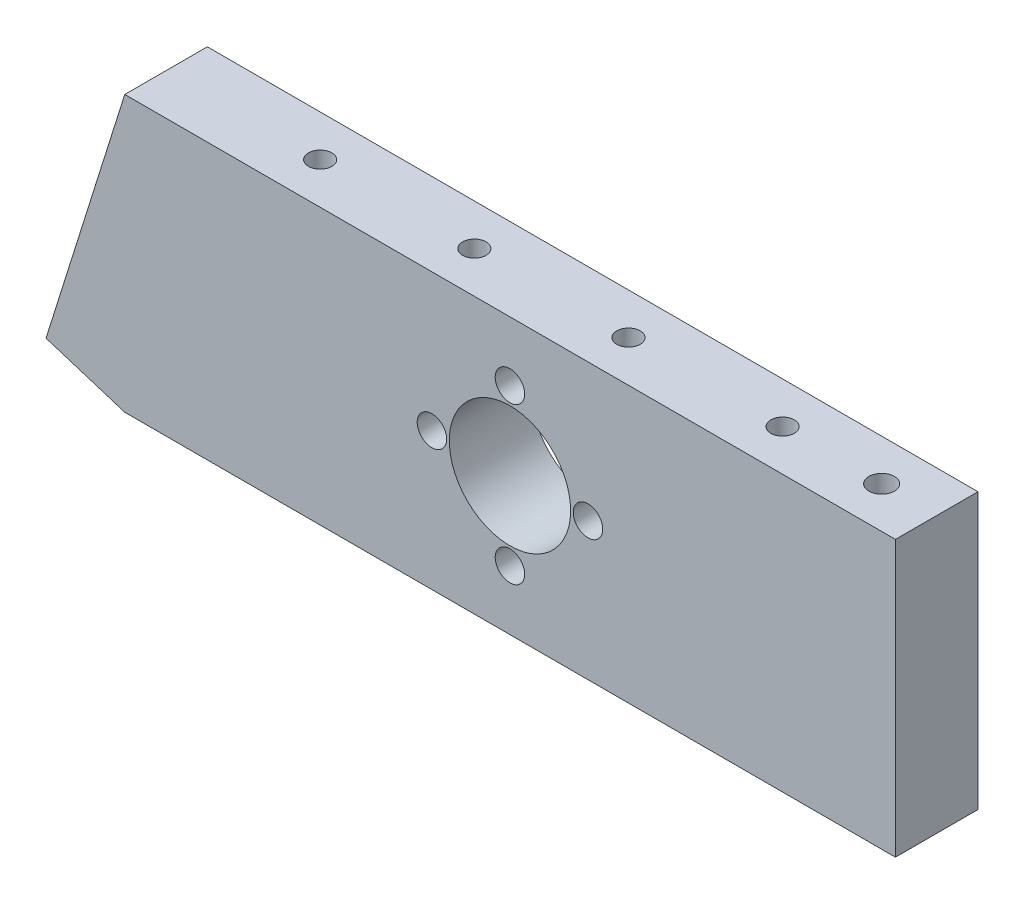
ISO-10303-21;
HEADER;
FILE_DESCRIPTION(('STEP AP214'),'2;1');
FILE_NAME('part.step','',(''),(''),'','','');
FILE_SCHEMA(('AUTOMOTIVE_DESIGN { 1 0 10303 214 1 1 1 1 }'));
ENDSEC;
DATA;
#1=APPLICATION_CONTEXT('core data for automotive mechanical design processes');
#2=APPLICATION_PROTOCOL_DEFINITION('international standard','automotive_design',2000,#1);
#3=PRODUCT_CONTEXT('',#1,'mechanical');
#4=PRODUCT('Part','Part','',(#3));
#5=PRODUCT_RELATED_PRODUCT_CATEGORY('part','',(#4));
#6=PRODUCT_DEFINITION_FORMATION('','',#4);
#7=PRODUCT_DEFINITION_CONTEXT('part definition',#1,'design');
#8=PRODUCT_DEFINITION('design','',#6,#7);
#9=PRODUCT_DEFINITION_SHAPE('','',#8);
#10=(LENGTH_UNIT() NAMED_UNIT(*) SI_UNIT(.MILLI.,.METRE.));
#11=(NAMED_UNIT(*) PLANE_ANGLE_UNIT() SI_UNIT($,.RADIAN.));
#12=(NAMED_UNIT(*) SI_UNIT($,.STERADIAN.) SOLID_ANGLE_UNIT());
#13=UNCERTAINTY_MEASURE_WITH_UNIT(LENGTH_MEASURE(1.E-05),#10,'distance_accuracy_value','');
#14=(GEOMETRIC_REPRESENTATION_CONTEXT(3) GLOBAL_UNCERTAINTY_ASSIGNED_CONTEXT((#13)) GLOBAL_UNIT_ASSIGNED_CONTEXT((#10,
#11,#12)) REPRESENTATION_CONTEXT('',''));
#15=CARTESIAN_POINT('',(0.,0.,0.));
#16=DIRECTION('',(0.,0.,1.));
#17=DIRECTION('',(1.,0.,0.));
#18=AXIS2_PLACEMENT_3D('',#15,#16,#17);
#19=CARTESIAN_POINT('',(0.,0.,9.525));
#20=DIRECTION('',(0.,0.,1.));
#21=DIRECTION('',(1.,0.,0.));
#22=AXIS2_PLACEMENT_3D('',#19,#20,#21);
#23=PLANE('',#22);
#24=CARTESIAN_POINT('',(9.,0.,9.525));
#25=DIRECTION('',(0.,0.,1.));
#26=DIRECTION('',(1.,0.,0.));
#27=AXIS2_PLACEMENT_3D('',#24,#25,#26);
#28=CIRCLE('',#27,1.7);
#29=CARTESIAN_POINT('',(10.7,0.,9.525));
#30=VERTEX_POINT('',#29);
#31=EDGE_CURVE('E324',#30,#30,#28,.T.);
#32=ORIENTED_EDGE('',*,*,#31,.F.);
#33=EDGE_LOOP('',(#32));
#34=FACE_BOUND('',#33,.T.);
#35=CARTESIAN_POINT('',(-9.,0.,9.525));
#36=DIRECTION('',(0.,0.,1.));
#37=DIRECTION('',(1.,0.,0.));
#38=AXIS2_PLACEMENT_3D('',#35,#36,#37);
#39=CIRCLE('',#38,1.7);
#40=CARTESIAN_POINT('',(-7.3,0.,9.525));
#41=VERTEX_POINT('',#40);
#42=EDGE_CURVE('E336',#41,#41,#39,.T.);
#43=ORIENTED_EDGE('',*,*,#42,.F.);
#44=EDGE_LOOP('',(#43));
#45=FACE_BOUND('',#44,.T.);
#46=DIRECTION('',(0.,1.,0.));
#47=VECTOR('',#46,1.);
#48=CARTESIAN_POINT('',(44.4670417670357,15.875,9.525));
#49=LINE('',#48,#47);
#50=CARTESIAN_POINT('',(44.4670417670356,-15.875,9.525));
#51=VERTEX_POINT('',#50);
#52=CARTESIAN_POINT('',(44.4670417670357,15.875,9.525));
#53=VERTEX_POINT('',#52);
#54=EDGE_CURVE('E125',#51,#53,#49,.T.);
#55=ORIENTED_EDGE('',*,*,#54,.T.);
#56=DIRECTION('',(-1.,0.,0.));
#57=VECTOR('',#56,1.);
#58=CARTESIAN_POINT('',(-44.4329582329643,15.875,9.525));
#59=LINE('',#58,#57);
#60=CARTESIAN_POINT('',(-44.4329582329643,15.875,9.525));
#61=VERTEX_POINT('',#60);
#62=EDGE_CURVE('E90',#53,#61,#59,.T.);
#63=ORIENTED_EDGE('',*,*,#62,.T.);
#64=DIRECTION('',(-0.299999999999992,-0.953939201416948,0.));
#65=VECTOR('',#64,1.);
#66=CARTESIAN_POINT('',(-44.4329582329643,15.875,9.525));
#67=LINE('',#66,#65);
#68=CARTESIAN_POINT('',(-53.5192291264606,-13.0175000000005,9.525));
#69=VERTEX_POINT('',#68);
#70=EDGE_CURVE('E96',#61,#69,#67,.T.);
#71=ORIENTED_EDGE('',*,*,#70,.T.);
#72=DIRECTION('',(0.953939201416947,-0.299999999999997,0.));
#73=VECTOR('',#72,1.);
#74=CARTESIAN_POINT('',(-44.4329582329642,-15.8750000000004,9.525));
#75=LINE('',#74,#73);
#76=CARTESIAN_POINT('',(-44.4329582329642,-15.8750000000004,9.525));
#77=VERTEX_POINT('',#76);
#78=EDGE_CURVE('E100',#69,#77,#75,.T.);
#79=ORIENTED_EDGE('',*,*,#78,.T.);
#80=DIRECTION('',(1.,0.,0.));
#81=VECTOR('',#80,1.);
#82=CARTESIAN_POINT('',(-44.4329582329642,-15.8750000000004,9.525));
#83=LINE('',#82,#81);
#84=EDGE_CURVE('E55',#77,#51,#83,.T.);
#85=ORIENTED_EDGE('',*,*,#84,.T.);
#86=EDGE_LOOP('',(#55,#63,#71,#79,#85));
#87=FACE_BOUND('',#86,.T.);
#88=CARTESIAN_POINT('',(0.,-9.00000000000001,9.525));
#89=DIRECTION('',(0.,0.,1.));
#90=DIRECTION('',(1.,0.,0.));
#91=AXIS2_PLACEMENT_3D('',#88,#89,#90);
#92=CIRCLE('',#91,1.7);
#93=CARTESIAN_POINT('',(1.7,-9.00000000000001,9.525));
#94=VERTEX_POINT('',#93);
#95=EDGE_CURVE('E120',#94,#94,#92,.T.);
#96=ORIENTED_EDGE('',*,*,#95,.F.);
#97=EDGE_LOOP('',(#96));
#98=FACE_BOUND('',#97,.T.);
#99=CARTESIAN_POINT('',(0.,9.,9.525));
#100=DIRECTION('',(0.,0.,1.));
#101=DIRECTION('',(1.,0.,0.));
#102=AXIS2_PLACEMENT_3D('',#99,#100,#101);
#103=CIRCLE('',#102,1.7);
#104=CARTESIAN_POINT('',(1.7,9.,9.525));
#105=VERTEX_POINT('',#104);
#106=EDGE_CURVE('E330',#105,#105,#103,.T.);
#107=ORIENTED_EDGE('',*,*,#106,.F.);
#108=EDGE_LOOP('',(#107));
#109=FACE_BOUND('',#108,.T.);
#110=CARTESIAN_POINT('',(1.95156391047391E-13,1.94289029309402E-13,9.525));
#111=DIRECTION('',(0.,0.,1.));
#112=DIRECTION('',(1.,0.,0.));
#113=AXIS2_PLACEMENT_3D('',#110,#111,#112);
#114=CIRCLE('',#113,6.99999999999976);
#115=CARTESIAN_POINT('',(6.99999999999995,1.94289029309402E-13,9.525));
#116=VERTEX_POINT('',#115);
#117=EDGE_CURVE('E318',#116,#116,#114,.T.);
#118=ORIENTED_EDGE('',*,*,#117,.F.);
#119=EDGE_LOOP('',(#118));
#120=FACE_BOUND('',#119,.T.);
#121=ADVANCED_FACE('F38',(#34,#45,#87,#98,#109,#120),#23,.T.);
#122=CARTESIAN_POINT('',(0.,0.,0.));
#123=DIRECTION('',(0.,0.,1.));
#124=DIRECTION('',(1.,0.,0.));
#125=AXIS2_PLACEMENT_3D('',#122,#123,#124);
#126=PLANE('',#125);
#127=DIRECTION('',(0.,1.,0.));
#128=VECTOR('',#127,1.);
#129=CARTESIAN_POINT('',(44.4670417670357,15.875,0.));
#130=LINE('',#129,#128);
#131=CARTESIAN_POINT('',(44.4670417670356,-15.875,0.));
#132=VERTEX_POINT('',#131);
#133=CARTESIAN_POINT('',(44.4670417670357,15.875,0.));
#134=VERTEX_POINT('',#133);
#135=EDGE_CURVE('E116',#132,#134,#130,.T.);
#136=ORIENTED_EDGE('',*,*,#135,.F.);
#137=DIRECTION('',(1.,0.,0.));
#138=VECTOR('',#137,1.);
#139=CARTESIAN_POINT('',(-44.4329582329642,-15.8750000000004,0.));
#140=LINE('',#139,#138);
#141=CARTESIAN_POINT('',(-44.4329582329642,-15.8750000000004,0.));
#142=VERTEX_POINT('',#141);
#143=EDGE_CURVE('E82',#142,#132,#140,.T.);
#144=ORIENTED_EDGE('',*,*,#143,.F.);
#145=DIRECTION('',(0.953939201416947,-0.299999999999997,0.));
#146=VECTOR('',#145,1.);
#147=CARTESIAN_POINT('',(-44.4329582329642,-15.8750000000004,0.));
#148=LINE('',#147,#146);
#149=CARTESIAN_POINT('',(-53.5192291264606,-13.0175000000005,0.));
#150=VERTEX_POINT('',#149);
#151=EDGE_CURVE('E76',#150,#142,#148,.T.);
#152=ORIENTED_EDGE('',*,*,#151,.F.);
#153=DIRECTION('',(-0.299999999999992,-0.953939201416948,0.));
#154=VECTOR('',#153,1.);
#155=CARTESIAN_POINT('',(-44.4329582329643,15.875,0.));
#156=LINE('',#155,#154);
#157=CARTESIAN_POINT('',(-44.4329582329643,15.875,0.));
#158=VERTEX_POINT('',#157);
#159=EDGE_CURVE('E107',#158,#150,#156,.T.);
#160=ORIENTED_EDGE('',*,*,#159,.F.);
#161=DIRECTION('',(-1.,0.,0.));
#162=VECTOR('',#161,1.);
#163=CARTESIAN_POINT('',(-44.4329582329643,15.875,0.));
#164=LINE('',#163,#162);
#165=EDGE_CURVE('E119',#134,#158,#164,.T.);
#166=ORIENTED_EDGE('',*,*,#165,.F.);
#167=EDGE_LOOP('',(#136,#144,#152,#160,#166));
#168=FACE_BOUND('',#167,.T.);
#169=CARTESIAN_POINT('',(0.,-9.00000000000001,0.));
#170=DIRECTION('',(0.,0.,1.));
#171=DIRECTION('',(1.,0.,0.));
#172=AXIS2_PLACEMENT_3D('',#169,#170,#171);
#173=CIRCLE('',#172,1.7);
#174=CARTESIAN_POINT('',(1.7,-9.00000000000001,0.));
#175=VERTEX_POINT('',#174);
#176=EDGE_CURVE('E339',#175,#175,#173,.T.);
#177=ORIENTED_EDGE('',*,*,#176,.T.);
#178=EDGE_LOOP('',(#177));
#179=FACE_BOUND('',#178,.T.);
#180=CARTESIAN_POINT('',(-9.,0.,0.));
#181=DIRECTION('',(0.,0.,1.));
#182=DIRECTION('',(1.,0.,0.));
#183=AXIS2_PLACEMENT_3D('',#180,#181,#182);
#184=CIRCLE('',#183,1.7);
#185=CARTESIAN_POINT('',(-7.3,0.,0.));
#186=VERTEX_POINT('',#185);
#187=EDGE_CURVE('E333',#186,#186,#184,.T.);
#188=ORIENTED_EDGE('',*,*,#187,.T.);
#189=EDGE_LOOP('',(#188));
#190=FACE_BOUND('',#189,.T.);
#191=CARTESIAN_POINT('',(0.,9.,0.));
#192=DIRECTION('',(0.,0.,1.));
#193=DIRECTION('',(1.,0.,0.));
#194=AXIS2_PLACEMENT_3D('',#191,#192,#193);
#195=CIRCLE('',#194,1.7);
#196=CARTESIAN_POINT('',(1.7,9.,0.));
#197=VERTEX_POINT('',#196);
#198=EDGE_CURVE('E327',#197,#197,#195,.T.);
#199=ORIENTED_EDGE('',*,*,#198,.T.);
#200=EDGE_LOOP('',(#199));
#201=FACE_BOUND('',#200,.T.);
#202=CARTESIAN_POINT('',(9.,0.,0.));
#203=DIRECTION('',(0.,0.,1.));
#204=DIRECTION('',(1.,0.,0.));
#205=AXIS2_PLACEMENT_3D('',#202,#203,#204);
#206=CIRCLE('',#205,1.7);
#207=CARTESIAN_POINT('',(10.7,0.,0.));
#208=VERTEX_POINT('',#207);
#209=EDGE_CURVE('E321',#208,#208,#206,.T.);
#210=ORIENTED_EDGE('',*,*,#209,.T.);
#211=EDGE_LOOP('',(#210));
#212=FACE_BOUND('',#211,.T.);
#213=CARTESIAN_POINT('',(1.95156391047391E-13,1.94289029309402E-13,0.));
#214=DIRECTION('',(0.,0.,1.));
#215=DIRECTION('',(1.,0.,0.));
#216=AXIS2_PLACEMENT_3D('',#213,#214,#215);
#217=CIRCLE('',#216,6.99999999999976);
#218=CARTESIAN_POINT('',(6.99999999999995,1.94289029309402E-13,0.));
#219=VERTEX_POINT('',#218);
#220=EDGE_CURVE('E317',#219,#219,#217,.T.);
#221=ORIENTED_EDGE('',*,*,#220,.T.);
#222=EDGE_LOOP('',(#221));
#223=FACE_BOUND('',#222,.T.);
#224=ADVANCED_FACE('F129',(#168,#179,#190,#201,#212,#223),#126,.F.);
#225=CARTESIAN_POINT('',(44.4670417670357,15.875,9.525));
#226=DIRECTION('',(-1.,0.,0.));
#227=DIRECTION('',(0.,-1.,0.));
#228=AXIS2_PLACEMENT_3D('',#225,#226,#227);
#229=PLANE('',#228);
#230=ORIENTED_EDGE('',*,*,#135,.T.);
#231=DIRECTION('',(0.,0.,-1.));
#232=VECTOR('',#231,1.);
#233=CARTESIAN_POINT('',(44.4670417670357,15.875,9.525));
#234=LINE('',#233,#232);
#235=EDGE_CURVE('E11',#53,#134,#234,.T.);
#236=ORIENTED_EDGE('',*,*,#235,.F.);
#237=ORIENTED_EDGE('',*,*,#54,.F.);
#238=DIRECTION('',(0.,0.,-1.));
#239=VECTOR('',#238,1.);
#240=CARTESIAN_POINT('',(44.4670417670356,-15.875,9.525));
#241=LINE('',#240,#239);
#242=EDGE_CURVE('E112',#51,#132,#241,.T.);
#243=ORIENTED_EDGE('',*,*,#242,.T.);
#244=EDGE_LOOP('',(#230,#236,#237,#243));
#245=FACE_BOUND('',#244,.T.);
#246=ADVANCED_FACE('F40',(#245),#229,.F.);
#247=CARTESIAN_POINT('',(-44.4329582329643,15.875,9.525));
#248=DIRECTION('',(0.,-1.,0.));
#249=DIRECTION('',(1.,0.,0.));
#250=AXIS2_PLACEMENT_3D('',#247,#248,#249);
#251=PLANE('',#250);
#252=CARTESIAN_POINT('',(38.1170417670356,15.875,4.7625));
#253=DIRECTION('',(0.,-1.,0.));
#254=DIRECTION('',(1.,0.,0.));
#255=AXIS2_PLACEMENT_3D('',#252,#253,#254);
#256=CIRCLE('',#255,1.4732);
#257=CARTESIAN_POINT('',(39.5902417670356,15.875,4.7625));
#258=VERTEX_POINT('',#257);
#259=EDGE_CURVE('E259',#258,#258,#256,.T.);
#260=ORIENTED_EDGE('',*,*,#259,.T.);
#261=EDGE_LOOP('',(#260));
#262=FACE_BOUND('',#261,.T.);
#263=CARTESIAN_POINT('',(26.6870417670356,15.8750000000001,4.7625));
#264=DIRECTION('',(0.,-1.,0.));
#265=DIRECTION('',(0.,0.,-1.));
#266=AXIS2_PLACEMENT_3D('',#263,#264,#265);
#267=CIRCLE('',#266,1.35255);
#268=CARTESIAN_POINT('',(26.6870417670356,15.8750000000001,3.40995));
#269=VERTEX_POINT('',#268);
#270=EDGE_CURVE('E270',#269,#269,#267,.T.);
#271=ORIENTED_EDGE('',*,*,#270,.T.);
#272=EDGE_LOOP('',(#271));
#273=FACE_BOUND('',#272,.T.);
#274=CARTESIAN_POINT('',(8.90704176703563,15.8750000000002,4.7625));
#275=DIRECTION('',(0.,-1.,0.));
#276=DIRECTION('',(0.,0.,-1.));
#277=AXIS2_PLACEMENT_3D('',#274,#275,#276);
#278=CIRCLE('',#277,1.35255);
#279=CARTESIAN_POINT('',(8.90704176703563,15.8750000000002,3.40995));
#280=VERTEX_POINT('',#279);
#281=EDGE_CURVE('E278',#280,#280,#278,.T.);
#282=ORIENTED_EDGE('',*,*,#281,.T.);
#283=EDGE_LOOP('',(#282));
#284=FACE_BOUND('',#283,.T.);
#285=CARTESIAN_POINT('',(-8.87295823296437,15.8750000000003,4.7625));
#286=DIRECTION('',(0.,-1.,0.));
#287=DIRECTION('',(0.,0.,-1.));
#288=AXIS2_PLACEMENT_3D('',#285,#286,#287);
#289=CIRCLE('',#288,1.35255);
#290=CARTESIAN_POINT('',(-8.87295823296437,15.8750000000003,3.40995));
#291=VERTEX_POINT('',#290);
#292=EDGE_CURVE('E284',#291,#291,#289,.T.);
#293=ORIENTED_EDGE('',*,*,#292,.T.);
#294=EDGE_LOOP('',(#293));
#295=FACE_BOUND('',#294,.T.);
#296=CARTESIAN_POINT('',(-26.6529582329644,15.8750000000004,4.7625));
#297=DIRECTION('',(0.,-1.,0.));
#298=DIRECTION('',(0.,0.,-1.));
#299=AXIS2_PLACEMENT_3D('',#296,#297,#298);
#300=CIRCLE('',#299,1.35255);
#301=CARTESIAN_POINT('',(-26.6529582329644,15.8750000000004,3.40995));
#302=VERTEX_POINT('',#301);
#303=EDGE_CURVE('E268',#302,#302,#300,.T.);
#304=ORIENTED_EDGE('',*,*,#303,.T.);
#305=EDGE_LOOP('',(#304));
#306=FACE_BOUND('',#305,.T.);
#307=ORIENTED_EDGE('',*,*,#165,.T.);
#308=DIRECTION('',(0.,0.,-1.));
#309=VECTOR('',#308,1.);
#310=CARTESIAN_POINT('',(-44.4329582329643,15.875,9.525));
#311=LINE('',#310,#309);
#312=EDGE_CURVE('E47',#61,#158,#311,.T.);
#313=ORIENTED_EDGE('',*,*,#312,.F.);
#314=ORIENTED_EDGE('',*,*,#62,.F.);
#315=ORIENTED_EDGE('',*,*,#235,.T.);
#316=EDGE_LOOP('',(#307,#313,#314,#315));
#317=FACE_BOUND('',#316,.T.);
#318=ADVANCED_FACE('F390',(#262,#273,#284,#295,#306,#317),#251,.F.);
#319=CARTESIAN_POINT('',(-44.4329582329643,15.875,9.525));
#320=DIRECTION('',(0.953939201416948,-0.299999999999992,0.));
#321=DIRECTION('',(0.299999999999992,0.953939201416948,0.));
#322=AXIS2_PLACEMENT_3D('',#319,#320,#321);
#323=PLANE('',#322);
#324=ORIENTED_EDGE('',*,*,#159,.T.);
#325=DIRECTION('',(0.,0.,-1.));
#326=VECTOR('',#325,1.);
#327=CARTESIAN_POINT('',(-53.5192291264606,-13.0175000000005,9.525));
#328=LINE('',#327,#326);
#329=EDGE_CURVE('E104',#69,#150,#328,.T.);
#330=ORIENTED_EDGE('',*,*,#329,.F.);
#331=ORIENTED_EDGE('',*,*,#70,.F.);
#332=ORIENTED_EDGE('',*,*,#312,.T.);
#333=EDGE_LOOP('',(#324,#330,#331,#332));
#334=FACE_BOUND('',#333,.T.);
#335=ADVANCED_FACE('F105',(#334),#323,.F.);
#336=CARTESIAN_POINT('',(-44.4329582329642,-15.8750000000004,9.525));
#337=DIRECTION('',(0.299999999999997,0.953939201416947,0.));
#338=DIRECTION('',(-0.953939201416947,0.299999999999997,0.));
#339=AXIS2_PLACEMENT_3D('',#336,#337,#338);
#340=PLANE('',#339);
#341=ORIENTED_EDGE('',*,*,#151,.T.);
#342=DIRECTION('',(0.,0.,-1.));
#343=VECTOR('',#342,1.);
#344=CARTESIAN_POINT('',(-44.4329582329642,-15.8750000000004,9.525));
#345=LINE('',#344,#343);
#346=EDGE_CURVE('E108',#77,#142,#345,.T.);
#347=ORIENTED_EDGE('',*,*,#346,.F.);
#348=ORIENTED_EDGE('',*,*,#78,.F.);
#349=ORIENTED_EDGE('',*,*,#329,.T.);
#350=EDGE_LOOP('',(#341,#347,#348,#349));
#351=FACE_BOUND('',#350,.T.);
#352=ADVANCED_FACE('F110',(#351),#340,.F.);
#353=CARTESIAN_POINT('',(-44.4329582329642,-15.8750000000004,9.525));
#354=DIRECTION('',(0.,1.,0.));
#355=DIRECTION('',(-1.,0.,0.));
#356=AXIS2_PLACEMENT_3D('',#353,#354,#355);
#357=PLANE('',#356);
#358=CARTESIAN_POINT('',(38.1170417670356,-15.875,4.7625));
#359=DIRECTION('',(0.,-1.,0.));
#360=DIRECTION('',(1.,0.,0.));
#361=AXIS2_PLACEMENT_3D('',#358,#359,#360);
#362=CIRCLE('',#361,1.4732);
#363=CARTESIAN_POINT('',(39.5902417670356,-15.875,4.7625));
#364=VERTEX_POINT('',#363);
#365=EDGE_CURVE('E258',#364,#364,#362,.T.);
#366=ORIENTED_EDGE('',*,*,#365,.F.);
#367=EDGE_LOOP('',(#366));
#368=FACE_BOUND('',#367,.T.);
#369=CARTESIAN_POINT('',(-26.6529582329644,-15.8750000000004,4.7625));
#370=DIRECTION('',(0.,-1.,0.));
#371=DIRECTION('',(0.,0.,-1.));
#372=AXIS2_PLACEMENT_3D('',#369,#370,#371);
#373=CIRCLE('',#372,1.35255);
#374=CARTESIAN_POINT('',(-26.6529582329644,-15.8750000000004,3.40995));
#375=VERTEX_POINT('',#374);
#376=EDGE_CURVE('E277',#375,#375,#373,.T.);
#377=ORIENTED_EDGE('',*,*,#376,.F.);
#378=EDGE_LOOP('',(#377));
#379=FACE_BOUND('',#378,.T.);
#380=CARTESIAN_POINT('',(-8.87295823296437,-15.8750000000003,4.7625));
#381=DIRECTION('',(0.,-1.,0.));
#382=DIRECTION('',(0.,0.,-1.));
#383=AXIS2_PLACEMENT_3D('',#380,#381,#382);
#384=CIRCLE('',#383,1.35255);
#385=CARTESIAN_POINT('',(-8.87295823296437,-15.8750000000003,3.40995));
#386=VERTEX_POINT('',#385);
#387=EDGE_CURVE('E299',#386,#386,#384,.T.);
#388=ORIENTED_EDGE('',*,*,#387,.F.);
#389=EDGE_LOOP('',(#388));
#390=FACE_BOUND('',#389,.T.);
#391=CARTESIAN_POINT('',(8.90704176703563,-15.8750000000002,4.7625));
#392=DIRECTION('',(0.,-1.,0.));
#393=DIRECTION('',(0.,0.,-1.));
#394=AXIS2_PLACEMENT_3D('',#391,#392,#393);
#395=CIRCLE('',#394,1.35255);
#396=CARTESIAN_POINT('',(8.90704176703563,-15.8750000000002,3.40995));
#397=VERTEX_POINT('',#396);
#398=EDGE_CURVE('E305',#397,#397,#395,.T.);
#399=ORIENTED_EDGE('',*,*,#398,.F.);
#400=EDGE_LOOP('',(#399));
#401=FACE_BOUND('',#400,.T.);
#402=CARTESIAN_POINT('',(26.6870417670356,-15.8750000000001,4.7625));
#403=DIRECTION('',(0.,-1.,0.));
#404=DIRECTION('',(0.,0.,-1.));
#405=AXIS2_PLACEMENT_3D('',#402,#403,#404);
#406=CIRCLE('',#405,1.35255);
#407=CARTESIAN_POINT('',(26.6870417670356,-15.8750000000001,3.40995));
#408=VERTEX_POINT('',#407);
#409=EDGE_CURVE('E311',#408,#408,#406,.T.);
#410=ORIENTED_EDGE('',*,*,#409,.F.);
#411=EDGE_LOOP('',(#410));
#412=FACE_BOUND('',#411,.T.);
#413=ORIENTED_EDGE('',*,*,#143,.T.);
#414=ORIENTED_EDGE('',*,*,#242,.F.);
#415=ORIENTED_EDGE('',*,*,#84,.F.);
#416=ORIENTED_EDGE('',*,*,#346,.T.);
#417=EDGE_LOOP('',(#413,#414,#415,#416));
#418=FACE_BOUND('',#417,.T.);
#419=ADVANCED_FACE('F134',(#368,#379,#390,#401,#412,#418),#357,.F.);
#420=CARTESIAN_POINT('',(0.,-9.00000000000001,9.525));
#421=DIRECTION('',(0.,0.,-1.));
#422=DIRECTION('',(-1.,0.,0.));
#423=AXIS2_PLACEMENT_3D('',#420,#421,#422);
#424=CYLINDRICAL_SURFACE('',#423,1.7);
#425=ORIENTED_EDGE('',*,*,#95,.T.);
#426=EDGE_LOOP('',(#425));
#427=FACE_BOUND('',#426,.T.);
#428=ORIENTED_EDGE('',*,*,#176,.F.);
#429=EDGE_LOOP('',(#428));
#430=FACE_BOUND('',#429,.T.);
#431=ADVANCED_FACE('F136',(#427,#430),#424,.F.);
#432=CARTESIAN_POINT('',(-9.,0.,9.525));
#433=DIRECTION('',(0.,0.,-1.));
#434=DIRECTION('',(-1.,0.,0.));
#435=AXIS2_PLACEMENT_3D('',#432,#433,#434);
#436=CYLINDRICAL_SURFACE('',#435,1.7);
#437=ORIENTED_EDGE('',*,*,#42,.T.);
#438=EDGE_LOOP('',(#437));
#439=FACE_BOUND('',#438,.T.);
#440=ORIENTED_EDGE('',*,*,#187,.F.);
#441=EDGE_LOOP('',(#440));
#442=FACE_BOUND('',#441,.T.);
#443=ADVANCED_FACE('F144',(#439,#442),#436,.F.);
#444=CARTESIAN_POINT('',(0.,9.,9.525));
#445=DIRECTION('',(0.,0.,-1.));
#446=DIRECTION('',(-1.,0.,0.));
#447=AXIS2_PLACEMENT_3D('',#444,#445,#446);
#448=CYLINDRICAL_SURFACE('',#447,1.7);
#449=ORIENTED_EDGE('',*,*,#106,.T.);
#450=EDGE_LOOP('',(#449));
#451=FACE_BOUND('',#450,.T.);
#452=ORIENTED_EDGE('',*,*,#198,.F.);
#453=EDGE_LOOP('',(#452));
#454=FACE_BOUND('',#453,.T.);
#455=ADVANCED_FACE('F163',(#451,#454),#448,.F.);
#456=CARTESIAN_POINT('',(9.,0.,9.525));
#457=DIRECTION('',(0.,0.,-1.));
#458=DIRECTION('',(-1.,0.,0.));
#459=AXIS2_PLACEMENT_3D('',#456,#457,#458);
#460=CYLINDRICAL_SURFACE('',#459,1.7);
#461=ORIENTED_EDGE('',*,*,#31,.T.);
#462=EDGE_LOOP('',(#461));
#463=FACE_BOUND('',#462,.T.);
#464=ORIENTED_EDGE('',*,*,#209,.F.);
#465=EDGE_LOOP('',(#464));
#466=FACE_BOUND('',#465,.T.);
#467=ADVANCED_FACE('F167',(#463,#466),#460,.F.);
#468=CARTESIAN_POINT('',(1.95156391047391E-13,1.94289029309402E-13,9.525));
#469=DIRECTION('',(0.,0.,-1.));
#470=DIRECTION('',(-1.,0.,0.));
#471=AXIS2_PLACEMENT_3D('',#468,#469,#470);
#472=CYLINDRICAL_SURFACE('',#471,6.99999999999976);
#473=ORIENTED_EDGE('',*,*,#117,.T.);
#474=EDGE_LOOP('',(#473));
#475=FACE_BOUND('',#474,.T.);
#476=ORIENTED_EDGE('',*,*,#220,.F.);
#477=EDGE_LOOP('',(#476));
#478=FACE_BOUND('',#477,.T.);
#479=ADVANCED_FACE('F171',(#475,#478),#472,.F.);
#480=CARTESIAN_POINT('',(26.6870417670356,-3.17499999999997,4.7625));
#481=DIRECTION('',(0.,-1.,0.));
#482=DIRECTION('',(0.,0.,-1.));
#483=AXIS2_PLACEMENT_3D('',#480,#481,#482);
#484=CONICAL_SURFACE('',#483,1.35255,1.02974425867665);
#485=CARTESIAN_POINT('',(26.6870417670356,-2.36230596973424,4.7625));
#486=VERTEX_POINT('',#485);
#487=VERTEX_LOOP('',#486);
#488=FACE_BOUND('',#487,.T.);
#489=CARTESIAN_POINT('',(26.6870417670356,-3.17499999999997,4.7625));
#490=DIRECTION('',(0.,-1.,0.));
#491=DIRECTION('',(0.,0.,-1.));
#492=AXIS2_PLACEMENT_3D('',#489,#490,#491);
#493=CIRCLE('',#492,1.35255);
#494=CARTESIAN_POINT('',(26.6870417670356,-3.17499999999997,3.40995));
#495=VERTEX_POINT('',#494);
#496=EDGE_CURVE('E314',#495,#495,#493,.T.);
#497=ORIENTED_EDGE('',*,*,#496,.T.);
#498=EDGE_LOOP('',(#497));
#499=FACE_BOUND('',#498,.T.);
#500=ADVANCED_FACE('F175',(#488,#499),#484,.F.);
#501=CARTESIAN_POINT('',(26.6870417670356,-15.8750000000001,4.7625));
#502=DIRECTION('',(0.,-1.,0.));
#503=DIRECTION('',(0.,0.,-1.));
#504=AXIS2_PLACEMENT_3D('',#501,#502,#503);
#505=CYLINDRICAL_SURFACE('',#504,1.35255);
#506=ORIENTED_EDGE('',*,*,#496,.F.);
#507=EDGE_LOOP('',(#506));
#508=FACE_BOUND('',#507,.T.);
#509=ORIENTED_EDGE('',*,*,#409,.T.);
#510=EDGE_LOOP('',(#509));
#511=FACE_BOUND('',#510,.T.);
#512=ADVANCED_FACE('F179',(#508,#511),#505,.F.);
#513=CARTESIAN_POINT('',(8.90704176703563,-3.17500000000007,4.7625));
#514=DIRECTION('',(0.,-1.,0.));
#515=DIRECTION('',(0.,0.,-1.));
#516=AXIS2_PLACEMENT_3D('',#513,#514,#515);
#517=CONICAL_SURFACE('',#516,1.35255,1.02974425867665);
#518=CARTESIAN_POINT('',(8.90704176703562,-2.36230596973434,4.7625));
#519=VERTEX_POINT('',#518);
#520=VERTEX_LOOP('',#519);
#521=FACE_BOUND('',#520,.T.);
#522=CARTESIAN_POINT('',(8.90704176703563,-3.17500000000007,4.7625));
#523=DIRECTION('',(0.,-1.,0.));
#524=DIRECTION('',(0.,0.,-1.));
#525=AXIS2_PLACEMENT_3D('',#522,#523,#524);
#526=CIRCLE('',#525,1.35255);
#527=CARTESIAN_POINT('',(8.90704176703563,-3.17500000000007,3.40995));
#528=VERTEX_POINT('',#527);
#529=EDGE_CURVE('E308',#528,#528,#526,.T.);
#530=ORIENTED_EDGE('',*,*,#529,.T.);
#531=EDGE_LOOP('',(#530));
#532=FACE_BOUND('',#531,.T.);
#533=ADVANCED_FACE('F183',(#521,#532),#517,.F.);
#534=CARTESIAN_POINT('',(8.90704176703563,-15.8750000000002,4.7625));
#535=DIRECTION('',(0.,-1.,0.));
#536=DIRECTION('',(0.,0.,-1.));
#537=AXIS2_PLACEMENT_3D('',#534,#535,#536);
#538=CYLINDRICAL_SURFACE('',#537,1.35255);
#539=ORIENTED_EDGE('',*,*,#529,.F.);
#540=EDGE_LOOP('',(#539));
#541=FACE_BOUND('',#540,.T.);
#542=ORIENTED_EDGE('',*,*,#398,.T.);
#543=EDGE_LOOP('',(#542));
#544=FACE_BOUND('',#543,.T.);
#545=ADVANCED_FACE('F187',(#541,#544),#538,.F.);
#546=CARTESIAN_POINT('',(-8.87295823296437,-3.17500000000016,4.7625));
#547=DIRECTION('',(0.,-1.,0.));
#548=DIRECTION('',(0.,0.,-1.));
#549=AXIS2_PLACEMENT_3D('',#546,#547,#548);
#550=CONICAL_SURFACE('',#549,1.35255,1.02974425867665);
#551=CARTESIAN_POINT('',(-8.87295823296437,-2.36230596973443,4.7625));
#552=VERTEX_POINT('',#551);
#553=VERTEX_LOOP('',#552);
#554=FACE_BOUND('',#553,.T.);
#555=CARTESIAN_POINT('',(-8.87295823296437,-3.17500000000016,4.7625));
#556=DIRECTION('',(0.,-1.,0.));
#557=DIRECTION('',(0.,0.,-1.));
#558=AXIS2_PLACEMENT_3D('',#555,#556,#557);
#559=CIRCLE('',#558,1.35255);
#560=CARTESIAN_POINT('',(-8.87295823296437,-3.17500000000016,3.40995));
#561=VERTEX_POINT('',#560);
#562=EDGE_CURVE('E302',#561,#561,#559,.T.);
#563=ORIENTED_EDGE('',*,*,#562,.T.);
#564=EDGE_LOOP('',(#563));
#565=FACE_BOUND('',#564,.T.);
#566=ADVANCED_FACE('F191',(#554,#565),#550,.F.);
#567=CARTESIAN_POINT('',(-8.87295823296437,-15.8750000000003,4.7625));
#568=DIRECTION('',(0.,-1.,0.));
#569=DIRECTION('',(0.,0.,-1.));
#570=AXIS2_PLACEMENT_3D('',#567,#568,#569);
#571=CYLINDRICAL_SURFACE('',#570,1.35255);
#572=ORIENTED_EDGE('',*,*,#562,.F.);
#573=EDGE_LOOP('',(#572));
#574=FACE_BOUND('',#573,.T.);
#575=ORIENTED_EDGE('',*,*,#387,.T.);
#576=EDGE_LOOP('',(#575));
#577=FACE_BOUND('',#576,.T.);
#578=ADVANCED_FACE('F195',(#574,#577),#571,.F.);
#579=CARTESIAN_POINT('',(-26.6529582329644,-3.17500000000025,4.7625));
#580=DIRECTION('',(0.,-1.,0.));
#581=DIRECTION('',(0.,0.,-1.));
#582=AXIS2_PLACEMENT_3D('',#579,#580,#581);
#583=CONICAL_SURFACE('',#582,1.35255,1.02974425867665);
#584=CARTESIAN_POINT('',(-26.6529582329644,-2.36230596973453,4.7625));
#585=VERTEX_POINT('',#584);
#586=VERTEX_LOOP('',#585);
#587=FACE_BOUND('',#586,.T.);
#588=CARTESIAN_POINT('',(-26.6529582329644,-3.17500000000025,4.7625));
#589=DIRECTION('',(0.,-1.,0.));
#590=DIRECTION('',(0.,0.,-1.));
#591=AXIS2_PLACEMENT_3D('',#588,#589,#590);
#592=CIRCLE('',#591,1.35255);
#593=CARTESIAN_POINT('',(-26.6529582329644,-3.17500000000025,3.40995));
#594=VERTEX_POINT('',#593);
#595=EDGE_CURVE('E296',#594,#594,#592,.T.);
#596=ORIENTED_EDGE('',*,*,#595,.T.);
#597=EDGE_LOOP('',(#596));
#598=FACE_BOUND('',#597,.T.);
#599=ADVANCED_FACE('F199',(#587,#598),#583,.F.);
#600=CARTESIAN_POINT('',(-26.6529582329644,-15.8750000000004,4.7625));
#601=DIRECTION('',(0.,-1.,0.));
#602=DIRECTION('',(0.,0.,-1.));
#603=AXIS2_PLACEMENT_3D('',#600,#601,#602);
#604=CYLINDRICAL_SURFACE('',#603,1.35255);
#605=ORIENTED_EDGE('',*,*,#595,.F.);
#606=EDGE_LOOP('',(#605));
#607=FACE_BOUND('',#606,.T.);
#608=ORIENTED_EDGE('',*,*,#376,.T.);
#609=EDGE_LOOP('',(#608));
#610=FACE_BOUND('',#609,.T.);
#611=ADVANCED_FACE('F203',(#607,#610),#604,.F.);
#612=CARTESIAN_POINT('',(-26.6529582329644,3.17500000000025,4.7625));
#613=DIRECTION('',(0.,1.,0.));
#614=DIRECTION('',(0.,0.,-1.));
#615=AXIS2_PLACEMENT_3D('',#612,#613,#614);
#616=CONICAL_SURFACE('',#615,1.35255,1.02974425867665);
#617=CARTESIAN_POINT('',(-26.6529582329644,2.36230596973453,4.7625));
#618=VERTEX_POINT('',#617);
#619=VERTEX_LOOP('',#618);
#620=FACE_BOUND('',#619,.T.);
#621=CARTESIAN_POINT('',(-26.6529582329644,3.17500000000025,4.7625));
#622=DIRECTION('',(0.,-1.,0.));
#623=DIRECTION('',(0.,0.,-1.));
#624=AXIS2_PLACEMENT_3D('',#621,#622,#623);
#625=CIRCLE('',#624,1.35255);
#626=CARTESIAN_POINT('',(-26.6529582329644,3.17500000000025,3.40995));
#627=VERTEX_POINT('',#626);
#628=EDGE_CURVE('E287',#627,#627,#625,.T.);
#629=ORIENTED_EDGE('',*,*,#628,.F.);
#630=EDGE_LOOP('',(#629));
#631=FACE_BOUND('',#630,.T.);
#632=ADVANCED_FACE('F207',(#620,#631),#616,.F.);
#633=CARTESIAN_POINT('',(-26.6529582329644,15.8750000000004,4.7625));
#634=DIRECTION('',(0.,1.,0.));
#635=DIRECTION('',(0.,0.,-1.));
#636=AXIS2_PLACEMENT_3D('',#633,#634,#635);
#637=CYLINDRICAL_SURFACE('',#636,1.35255);
#638=ORIENTED_EDGE('',*,*,#628,.T.);
#639=EDGE_LOOP('',(#638));
#640=FACE_BOUND('',#639,.T.);
#641=ORIENTED_EDGE('',*,*,#303,.F.);
#642=EDGE_LOOP('',(#641));
#643=FACE_BOUND('',#642,.T.);
#644=ADVANCED_FACE('F211',(#640,#643),#637,.F.);
#645=CARTESIAN_POINT('',(-8.87295823296437,3.17500000000016,4.7625));
#646=DIRECTION('',(0.,1.,0.));
#647=DIRECTION('',(0.,0.,-1.));
#648=AXIS2_PLACEMENT_3D('',#645,#646,#647);
#649=CONICAL_SURFACE('',#648,1.35255,1.02974425867665);
#650=CARTESIAN_POINT('',(-8.87295823296437,2.36230596973443,4.7625));
#651=VERTEX_POINT('',#650);
#652=VERTEX_LOOP('',#651);
#653=FACE_BOUND('',#652,.T.);
#654=CARTESIAN_POINT('',(-8.87295823296437,3.17500000000016,4.7625));
#655=DIRECTION('',(0.,-1.,0.));
#656=DIRECTION('',(0.,0.,-1.));
#657=AXIS2_PLACEMENT_3D('',#654,#655,#656);
#658=CIRCLE('',#657,1.35255);
#659=CARTESIAN_POINT('',(-8.87295823296437,3.17500000000016,3.40995));
#660=VERTEX_POINT('',#659);
#661=EDGE_CURVE('E281',#660,#660,#658,.T.);
#662=ORIENTED_EDGE('',*,*,#661,.F.);
#663=EDGE_LOOP('',(#662));
#664=FACE_BOUND('',#663,.T.);
#665=ADVANCED_FACE('F215',(#653,#664),#649,.F.);
#666=CARTESIAN_POINT('',(-8.87295823296437,15.8750000000003,4.7625));
#667=DIRECTION('',(0.,1.,0.));
#668=DIRECTION('',(0.,0.,-1.));
#669=AXIS2_PLACEMENT_3D('',#666,#667,#668);
#670=CYLINDRICAL_SURFACE('',#669,1.35255);
#671=ORIENTED_EDGE('',*,*,#661,.T.);
#672=EDGE_LOOP('',(#671));
#673=FACE_BOUND('',#672,.T.);
#674=ORIENTED_EDGE('',*,*,#292,.F.);
#675=EDGE_LOOP('',(#674));
#676=FACE_BOUND('',#675,.T.);
#677=ADVANCED_FACE('F219',(#673,#676),#670,.F.);
#678=CARTESIAN_POINT('',(8.90704176703563,3.17500000000007,4.7625));
#679=DIRECTION('',(0.,1.,0.));
#680=DIRECTION('',(0.,0.,-1.));
#681=AXIS2_PLACEMENT_3D('',#678,#679,#680);
#682=CONICAL_SURFACE('',#681,1.35255,1.02974425867665);
#683=CARTESIAN_POINT('',(8.90704176703562,2.36230596973434,4.7625));
#684=VERTEX_POINT('',#683);
#685=VERTEX_LOOP('',#684);
#686=FACE_BOUND('',#685,.T.);
#687=CARTESIAN_POINT('',(8.90704176703563,3.17500000000007,4.7625));
#688=DIRECTION('',(0.,-1.,0.));
#689=DIRECTION('',(0.,0.,-1.));
#690=AXIS2_PLACEMENT_3D('',#687,#688,#689);
#691=CIRCLE('',#690,1.35255);
#692=CARTESIAN_POINT('',(8.90704176703563,3.17500000000007,3.40995));
#693=VERTEX_POINT('',#692);
#694=EDGE_CURVE('E274',#693,#693,#691,.T.);
#695=ORIENTED_EDGE('',*,*,#694,.F.);
#696=EDGE_LOOP('',(#695));
#697=FACE_BOUND('',#696,.T.);
#698=ADVANCED_FACE('F223',(#686,#697),#682,.F.);
#699=CARTESIAN_POINT('',(8.90704176703563,15.8750000000002,4.7625));
#700=DIRECTION('',(0.,1.,0.));
#701=DIRECTION('',(0.,0.,-1.));
#702=AXIS2_PLACEMENT_3D('',#699,#700,#701);
#703=CYLINDRICAL_SURFACE('',#702,1.35255);
#704=ORIENTED_EDGE('',*,*,#694,.T.);
#705=EDGE_LOOP('',(#704));
#706=FACE_BOUND('',#705,.T.);
#707=ORIENTED_EDGE('',*,*,#281,.F.);
#708=EDGE_LOOP('',(#707));
#709=FACE_BOUND('',#708,.T.);
#710=ADVANCED_FACE('F227',(#706,#709),#703,.F.);
#711=CARTESIAN_POINT('',(26.6870417670356,3.17499999999997,4.7625));
#712=DIRECTION('',(0.,1.,0.));
#713=DIRECTION('',(0.,0.,-1.));
#714=AXIS2_PLACEMENT_3D('',#711,#712,#713);
#715=CONICAL_SURFACE('',#714,1.35255,1.02974425867665);
#716=CARTESIAN_POINT('',(26.6870417670356,2.36230596973424,4.7625));
#717=VERTEX_POINT('',#716);
#718=VERTEX_LOOP('',#717);
#719=FACE_BOUND('',#718,.T.);
#720=CARTESIAN_POINT('',(26.6870417670356,3.17499999999997,4.7625));
#721=DIRECTION('',(0.,-1.,0.));
#722=DIRECTION('',(0.,0.,-1.));
#723=AXIS2_PLACEMENT_3D('',#720,#721,#722);
#724=CIRCLE('',#723,1.35255);
#725=CARTESIAN_POINT('',(26.6870417670356,3.17499999999997,3.40995));
#726=VERTEX_POINT('',#725);
#727=EDGE_CURVE('E273',#726,#726,#724,.T.);
#728=ORIENTED_EDGE('',*,*,#727,.F.);
#729=EDGE_LOOP('',(#728));
#730=FACE_BOUND('',#729,.T.);
#731=ADVANCED_FACE('F231',(#719,#730),#715,.F.);
#732=CARTESIAN_POINT('',(26.6870417670356,15.8750000000001,4.7625));
#733=DIRECTION('',(0.,1.,0.));
#734=DIRECTION('',(0.,0.,-1.));
#735=AXIS2_PLACEMENT_3D('',#732,#733,#734);
#736=CYLINDRICAL_SURFACE('',#735,1.35255);
#737=ORIENTED_EDGE('',*,*,#727,.T.);
#738=EDGE_LOOP('',(#737));
#739=FACE_BOUND('',#738,.T.);
#740=ORIENTED_EDGE('',*,*,#270,.F.);
#741=EDGE_LOOP('',(#740));
#742=FACE_BOUND('',#741,.T.);
#743=ADVANCED_FACE('F235',(#739,#742),#736,.F.);
#744=CARTESIAN_POINT('',(38.1170417670356,-3.17500000000001,4.7625));
#745=DIRECTION('',(0.,-1.,0.));
#746=DIRECTION('',(1.,0.,0.));
#747=AXIS2_PLACEMENT_3D('',#744,#745,#746);
#748=CYLINDRICAL_SURFACE('',#747,1.4732);
#749=CARTESIAN_POINT('',(38.1170417670356,-3.17500000000001,4.7625));
#750=DIRECTION('',(0.,-1.,0.));
#751=DIRECTION('',(1.,0.,0.));
#752=AXIS2_PLACEMENT_3D('',#749,#750,#751);
#753=CIRCLE('',#752,1.4732);
#754=CARTESIAN_POINT('',(39.5902417670356,-3.17500000000001,4.7625));
#755=VERTEX_POINT('',#754);
#756=EDGE_CURVE('E262',#755,#755,#753,.T.);
#757=ORIENTED_EDGE('',*,*,#756,.F.);
#758=EDGE_LOOP('',(#757));
#759=FACE_BOUND('',#758,.T.);
#760=ORIENTED_EDGE('',*,*,#365,.T.);
#761=EDGE_LOOP('',(#760));
#762=FACE_BOUND('',#761,.T.);
#763=ADVANCED_FACE('F238',(#759,#762),#748,.F.);
#764=CARTESIAN_POINT('',(38.1170417670356,-3.17500000000001,4.7625));
#765=DIRECTION('',(0.,-1.,0.));
#766=DIRECTION('',(1.,0.,0.));
#767=AXIS2_PLACEMENT_3D('',#764,#765,#766);
#768=PLANE('',#767);
#769=ORIENTED_EDGE('',*,*,#756,.T.);
#770=EDGE_LOOP('',(#769));
#771=FACE_BOUND('',#770,.T.);
#772=ADVANCED_FACE('F241',(#771),#768,.T.);
#773=CARTESIAN_POINT('',(38.1170417670356,3.17500000000001,4.7625));
#774=DIRECTION('',(0.,1.,0.));
#775=DIRECTION('',(-1.,0.,0.));
#776=AXIS2_PLACEMENT_3D('',#773,#774,#775);
#777=CYLINDRICAL_SURFACE('',#776,1.4732);
#778=CARTESIAN_POINT('',(38.1170417670356,3.17500000000001,4.7625));
#779=DIRECTION('',(0.,-1.,0.));
#780=DIRECTION('',(1.,0.,0.));
#781=AXIS2_PLACEMENT_3D('',#778,#779,#780);
#782=CIRCLE('',#781,1.4732);
#783=CARTESIAN_POINT('',(39.5902417670356,3.17500000000001,4.7625));
#784=VERTEX_POINT('',#783);
#785=EDGE_CURVE('E257',#784,#784,#782,.T.);
#786=ORIENTED_EDGE('',*,*,#785,.T.);
#787=EDGE_LOOP('',(#786));
#788=FACE_BOUND('',#787,.T.);
#789=ORIENTED_EDGE('',*,*,#259,.F.);
#790=EDGE_LOOP('',(#789));
#791=FACE_BOUND('',#790,.T.);
#792=ADVANCED_FACE('F245',(#788,#791),#777,.F.);
#793=CARTESIAN_POINT('',(38.1170417670356,3.17500000000001,4.7625));
#794=DIRECTION('',(0.,1.,0.));
#795=DIRECTION('',(1.,0.,0.));
#796=AXIS2_PLACEMENT_3D('',#793,#794,#795);
#797=PLANE('',#796);
#798=ORIENTED_EDGE('',*,*,#785,.F.);
#799=EDGE_LOOP('',(#798));
#800=FACE_BOUND('',#799,.T.);
#801=ADVANCED_FACE('F249',(#800),#797,.T.);
#802=CLOSED_SHELL('',(#121,#224,#246,#318,#335,#352,#419,#431,#443,#455,#467,#479,#500,#512,
#533,#545,#566,#578,#599,#611,#632,#644,#665,#677,#698,#710,#731,#743,#763,#772,#792,#801));
#803=MANIFOLD_SOLID_BREP('B2',#802);
#804=ADVANCED_BREP_SHAPE_REPRESENTATION('',(#18,#803),#14);
#805=SHAPE_DEFINITION_REPRESENTATION(#9,#804);
ENDSEC;
END-ISO-10303-21;
